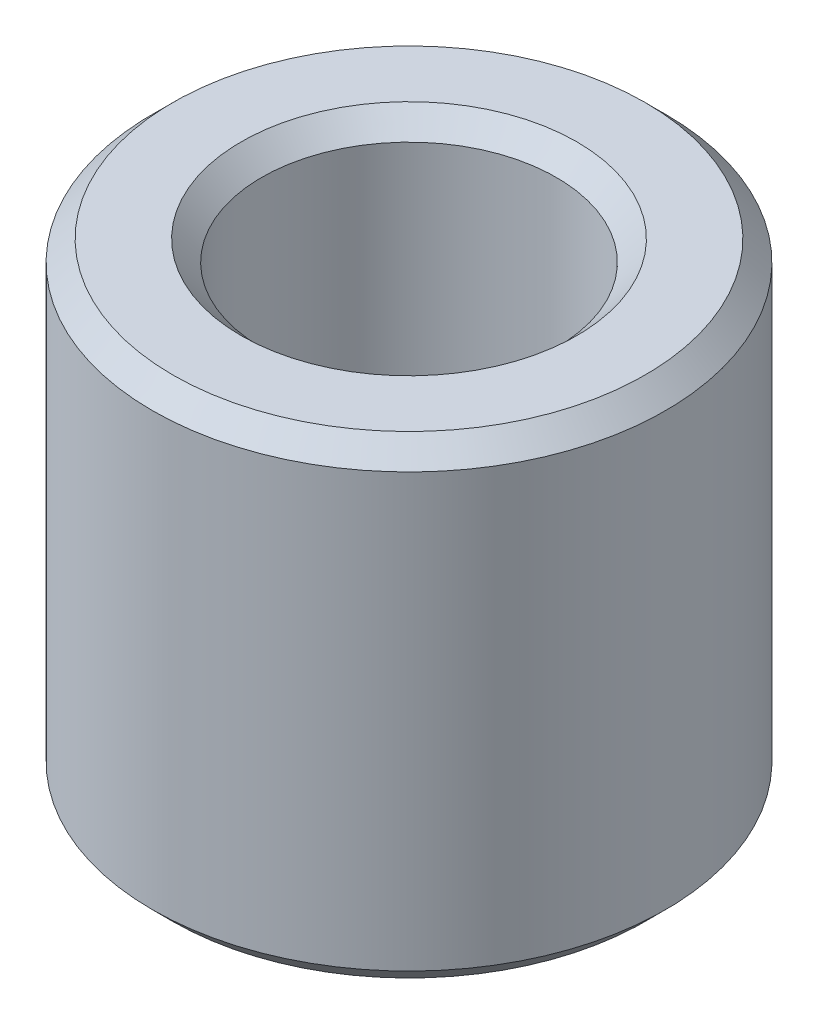
ISO-10303-21;
HEADER;
FILE_DESCRIPTION(('STEP AP214'),'2;1');
FILE_NAME('part.step','',(''),(''),'','','');
FILE_SCHEMA(('AUTOMOTIVE_DESIGN { 1 0 10303 214 1 1 1 1 }'));
ENDSEC;
DATA;
#1=APPLICATION_CONTEXT('core data for automotive mechanical design processes');
#2=APPLICATION_PROTOCOL_DEFINITION('international standard','automotive_design',2000,#1);
#3=PRODUCT_CONTEXT('',#1,'mechanical');
#4=PRODUCT('Part','Part','',(#3));
#5=PRODUCT_RELATED_PRODUCT_CATEGORY('part','',(#4));
#6=PRODUCT_DEFINITION_FORMATION('','',#4);
#7=PRODUCT_DEFINITION_CONTEXT('part definition',#1,'design');
#8=PRODUCT_DEFINITION('design','',#6,#7);
#9=PRODUCT_DEFINITION_SHAPE('','',#8);
#10=(LENGTH_UNIT() NAMED_UNIT(*) SI_UNIT(.MILLI.,.METRE.));
#11=(NAMED_UNIT(*) PLANE_ANGLE_UNIT() SI_UNIT($,.RADIAN.));
#12=(NAMED_UNIT(*) SI_UNIT($,.STERADIAN.) SOLID_ANGLE_UNIT());
#13=UNCERTAINTY_MEASURE_WITH_UNIT(LENGTH_MEASURE(1.E-05),#10,'distance_accuracy_value','');
#14=(GEOMETRIC_REPRESENTATION_CONTEXT(3) GLOBAL_UNCERTAINTY_ASSIGNED_CONTEXT((#13)) GLOBAL_UNIT_ASSIGNED_CONTEXT((#10,
#11,#12)) REPRESENTATION_CONTEXT('',''));
#15=CARTESIAN_POINT('',(0.,0.,0.));
#16=DIRECTION('',(0.,0.,1.));
#17=DIRECTION('',(1.,0.,0.));
#18=AXIS2_PLACEMENT_3D('',#15,#16,#17);
#19=CARTESIAN_POINT('',(0.,87.6036393041365,0.));
#20=DIRECTION('',(0.,-1.,0.));
#21=DIRECTION('',(0.,0.,-1.));
#22=AXIS2_PLACEMENT_3D('',#19,#20,#21);
#23=CYLINDRICAL_SURFACE('',#22,47.5);
#24=CARTESIAN_POINT('',(0.,3.7992212995087,0.));
#25=DIRECTION('',(0.,1.,0.));
#26=DIRECTION('',(0.,0.,1.));
#27=AXIS2_PLACEMENT_3D('',#24,#25,#26);
#28=CIRCLE('',#27,47.5);
#29=CARTESIAN_POINT('',(0.,3.7992212995087,47.5));
#30=VERTEX_POINT('',#29);
#31=EDGE_CURVE('E10',#30,#30,#28,.T.);
#32=ORIENTED_EDGE('',*,*,#31,.T.);
#33=EDGE_LOOP('',(#32));
#34=FACE_BOUND('',#33,.T.);
#35=CARTESIAN_POINT('',(0.,83.8044180046278,0.));
#36=DIRECTION('',(0.,1.,0.));
#37=DIRECTION('',(0.,0.,1.));
#38=AXIS2_PLACEMENT_3D('',#35,#36,#37);
#39=CIRCLE('',#38,47.5);
#40=CARTESIAN_POINT('',(0.,83.8044180046278,47.5));
#41=VERTEX_POINT('',#40);
#42=EDGE_CURVE('E50',#41,#41,#39,.F.);
#43=ORIENTED_EDGE('',*,*,#42,.T.);
#44=EDGE_LOOP('',(#43));
#45=FACE_BOUND('',#44,.T.);
#46=ADVANCED_FACE('F39',(#34,#45),#23,.T.);
#47=CARTESIAN_POINT('',(0.,87.6036393041365,0.));
#48=DIRECTION('',(0.,1.,0.));
#49=DIRECTION('',(0.,0.,1.));
#50=AXIS2_PLACEMENT_3D('',#47,#48,#49);
#51=PLANE('',#50);
#52=CARTESIAN_POINT('',(0.,87.6036393041365,0.));
#53=DIRECTION('',(0.,1.,0.));
#54=DIRECTION('',(0.,0.,1.));
#55=AXIS2_PLACEMENT_3D('',#52,#53,#54);
#56=CIRCLE('',#55,31.0746914609461);
#57=CARTESIAN_POINT('',(0.,87.6036393041365,31.0746914609461));
#58=VERTEX_POINT('',#57);
#59=EDGE_CURVE('E58',#58,#58,#56,.F.);
#60=ORIENTED_EDGE('',*,*,#59,.T.);
#61=EDGE_LOOP('',(#60));
#62=FACE_BOUND('',#61,.T.);
#63=CARTESIAN_POINT('',(0.,87.6036393041365,0.));
#64=DIRECTION('',(0.,1.,0.));
#65=DIRECTION('',(0.,0.,1.));
#66=AXIS2_PLACEMENT_3D('',#63,#64,#65);
#67=CIRCLE('',#66,43.7007787004913);
#68=CARTESIAN_POINT('',(0.,87.6036393041365,43.7007787004913));
#69=VERTEX_POINT('',#68);
#70=EDGE_CURVE('E61',#69,#69,#67,.T.);
#71=ORIENTED_EDGE('',*,*,#70,.T.);
#72=EDGE_LOOP('',(#71));
#73=FACE_BOUND('',#72,.T.);
#74=ADVANCED_FACE('F88',(#62,#73),#51,.T.);
#75=CARTESIAN_POINT('',(0.,0.,0.));
#76=DIRECTION('',(0.,1.,0.));
#77=DIRECTION('',(0.,0.,1.));
#78=AXIS2_PLACEMENT_3D('',#75,#76,#77);
#79=PLANE('',#78);
#80=CARTESIAN_POINT('',(0.,0.,0.));
#81=DIRECTION('',(0.,1.,0.));
#82=DIRECTION('',(0.,0.,1.));
#83=AXIS2_PLACEMENT_3D('',#80,#81,#82);
#84=CIRCLE('',#83,31.0746914609461);
#85=CARTESIAN_POINT('',(0.,0.,31.0746914609461));
#86=VERTEX_POINT('',#85);
#87=EDGE_CURVE('E51',#86,#86,#84,.T.);
#88=ORIENTED_EDGE('',*,*,#87,.T.);
#89=EDGE_LOOP('',(#88));
#90=FACE_BOUND('',#89,.T.);
#91=CARTESIAN_POINT('',(0.,0.,0.));
#92=DIRECTION('',(0.,1.,0.));
#93=DIRECTION('',(0.,0.,1.));
#94=AXIS2_PLACEMENT_3D('',#91,#92,#93);
#95=CIRCLE('',#94,43.7007787004913);
#96=CARTESIAN_POINT('',(0.,0.,43.7007787004913));
#97=VERTEX_POINT('',#96);
#98=EDGE_CURVE('E54',#97,#97,#95,.F.);
#99=ORIENTED_EDGE('',*,*,#98,.T.);
#100=EDGE_LOOP('',(#99));
#101=FACE_BOUND('',#100,.T.);
#102=ADVANCED_FACE('F83',(#90,#101),#79,.F.);
#103=CARTESIAN_POINT('',(0.,87.6036393041365,0.));
#104=DIRECTION('',(0.,-1.,0.));
#105=DIRECTION('',(0.,0.,-1.));
#106=AXIS2_PLACEMENT_3D('',#103,#104,#105);
#107=CYLINDRICAL_SURFACE('',#106,27.2754701614374);
#108=CARTESIAN_POINT('',(0.,83.8044180046278,0.));
#109=DIRECTION('',(0.,1.,0.));
#110=DIRECTION('',(0.,0.,1.));
#111=AXIS2_PLACEMENT_3D('',#108,#109,#110);
#112=CIRCLE('',#111,27.2754701614374);
#113=CARTESIAN_POINT('',(0.,83.8044180046278,27.2754701614374));
#114=VERTEX_POINT('',#113);
#115=EDGE_CURVE('E67',#114,#114,#112,.T.);
#116=ORIENTED_EDGE('',*,*,#115,.T.);
#117=EDGE_LOOP('',(#116));
#118=FACE_BOUND('',#117,.T.);
#119=CARTESIAN_POINT('',(0.,3.7992212995087,0.));
#120=DIRECTION('',(0.,1.,0.));
#121=DIRECTION('',(0.,0.,1.));
#122=AXIS2_PLACEMENT_3D('',#119,#120,#121);
#123=CIRCLE('',#122,27.2754701614374);
#124=CARTESIAN_POINT('',(0.,3.7992212995087,27.2754701614374));
#125=VERTEX_POINT('',#124);
#126=EDGE_CURVE('E69',#125,#125,#123,.F.);
#127=ORIENTED_EDGE('',*,*,#126,.T.);
#128=EDGE_LOOP('',(#127));
#129=FACE_BOUND('',#128,.T.);
#130=ADVANCED_FACE('F71',(#118,#129),#107,.F.);
#131=CARTESIAN_POINT('',(0.,83.8044180046278,0.));
#132=DIRECTION('',(0.,1.,0.));
#133=DIRECTION('',(0.,0.,1.));
#134=AXIS2_PLACEMENT_3D('',#131,#132,#133);
#135=CONICAL_SURFACE('',#134,27.2754701614374,0.78539816339745);
#136=ORIENTED_EDGE('',*,*,#59,.F.);
#137=EDGE_LOOP('',(#136));
#138=FACE_BOUND('',#137,.T.);
#139=ORIENTED_EDGE('',*,*,#115,.F.);
#140=EDGE_LOOP('',(#139));
#141=FACE_BOUND('',#140,.T.);
#142=ADVANCED_FACE('F77',(#138,#141),#135,.F.);
#143=CARTESIAN_POINT('',(0.,0.,0.));
#144=DIRECTION('',(0.,-1.,0.));
#145=DIRECTION('',(0.,0.,-1.));
#146=AXIS2_PLACEMENT_3D('',#143,#144,#145);
#147=CONICAL_SURFACE('',#146,31.0746914609461,0.785398163397447);
#148=ORIENTED_EDGE('',*,*,#126,.F.);
#149=EDGE_LOOP('',(#148));
#150=FACE_BOUND('',#149,.T.);
#151=ORIENTED_EDGE('',*,*,#87,.F.);
#152=EDGE_LOOP('',(#151));
#153=FACE_BOUND('',#152,.T.);
#154=ADVANCED_FACE('F73',(#150,#153),#147,.F.);
#155=CARTESIAN_POINT('',(0.,3.7992212995087,0.));
#156=DIRECTION('',(0.,1.,0.));
#157=DIRECTION('',(0.,0.,1.));
#158=AXIS2_PLACEMENT_3D('',#155,#156,#157);
#159=CONICAL_SURFACE('',#158,47.5,0.785398163397453);
#160=ORIENTED_EDGE('',*,*,#98,.F.);
#161=EDGE_LOOP('',(#160));
#162=FACE_BOUND('',#161,.T.);
#163=ORIENTED_EDGE('',*,*,#31,.F.);
#164=EDGE_LOOP('',(#163));
#165=FACE_BOUND('',#164,.T.);
#166=ADVANCED_FACE('F76',(#162,#165),#159,.T.);
#167=CARTESIAN_POINT('',(0.,87.6036393041365,0.));
#168=DIRECTION('',(0.,-1.,0.));
#169=DIRECTION('',(0.,0.,-1.));
#170=AXIS2_PLACEMENT_3D('',#167,#168,#169);
#171=CONICAL_SURFACE('',#170,43.7007787004913,0.785398163397444);
#172=ORIENTED_EDGE('',*,*,#42,.F.);
#173=EDGE_LOOP('',(#172));
#174=FACE_BOUND('',#173,.T.);
#175=ORIENTED_EDGE('',*,*,#70,.F.);
#176=EDGE_LOOP('',(#175));
#177=FACE_BOUND('',#176,.T.);
#178=ADVANCED_FACE('F45',(#174,#177),#171,.T.);
#179=CLOSED_SHELL('',(#46,#74,#102,#130,#142,#154,#166,#178));
#180=MANIFOLD_SOLID_BREP('B2',#179);
#181=ADVANCED_BREP_SHAPE_REPRESENTATION('',(#18,#180),#14);
#182=SHAPE_DEFINITION_REPRESENTATION(#9,#181);
ENDSEC;
END-ISO-10303-21;
